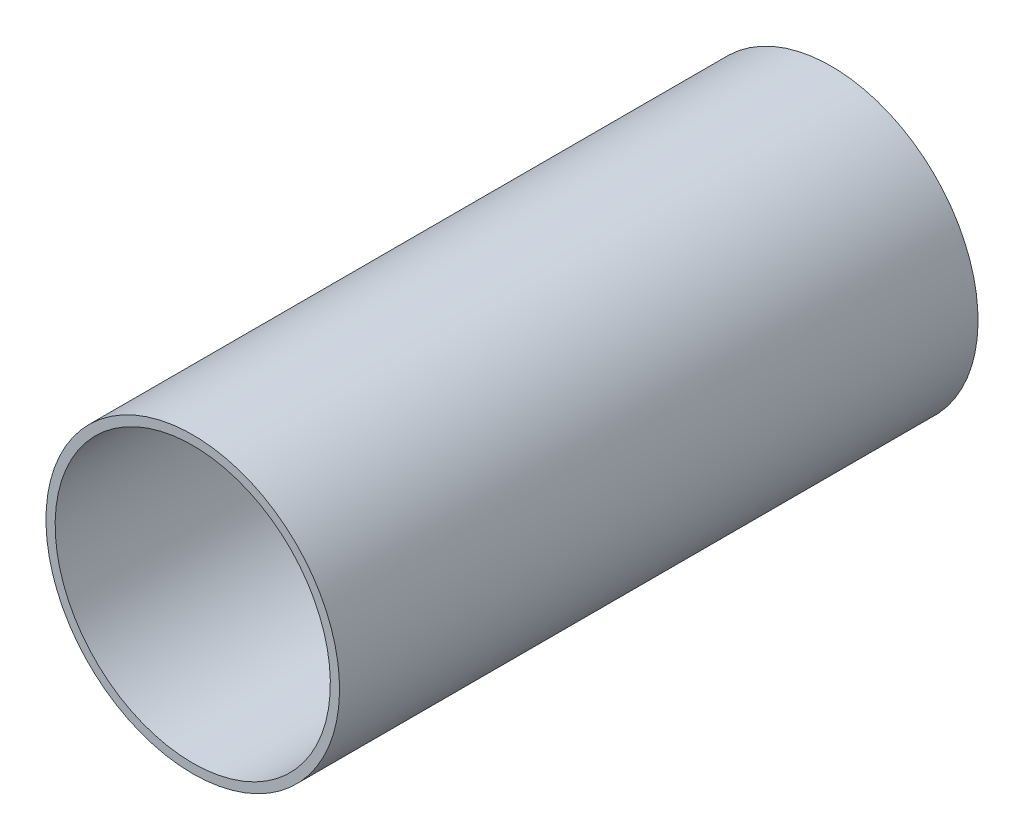
ISO-10303-21;
HEADER;
FILE_DESCRIPTION(('STEP AP214'),'2;1');
FILE_NAME('part.step','',(''),(''),'','','');
FILE_SCHEMA(('AUTOMOTIVE_DESIGN { 1 0 10303 214 1 1 1 1 }'));
ENDSEC;
DATA;
#1=APPLICATION_CONTEXT('core data for automotive mechanical design processes');
#2=APPLICATION_PROTOCOL_DEFINITION('international standard','automotive_design',2000,#1);
#3=PRODUCT_CONTEXT('',#1,'mechanical');
#4=PRODUCT('Part','Part','',(#3));
#5=PRODUCT_RELATED_PRODUCT_CATEGORY('part','',(#4));
#6=PRODUCT_DEFINITION_FORMATION('','',#4);
#7=PRODUCT_DEFINITION_CONTEXT('part definition',#1,'design');
#8=PRODUCT_DEFINITION('design','',#6,#7);
#9=PRODUCT_DEFINITION_SHAPE('','',#8);
#10=(LENGTH_UNIT() NAMED_UNIT(*) SI_UNIT(.MILLI.,.METRE.));
#11=(NAMED_UNIT(*) PLANE_ANGLE_UNIT() SI_UNIT($,.RADIAN.));
#12=(NAMED_UNIT(*) SI_UNIT($,.STERADIAN.) SOLID_ANGLE_UNIT());
#13=UNCERTAINTY_MEASURE_WITH_UNIT(LENGTH_MEASURE(1.E-05),#10,'distance_accuracy_value','');
#14=(GEOMETRIC_REPRESENTATION_CONTEXT(3) GLOBAL_UNCERTAINTY_ASSIGNED_CONTEXT((#13)) GLOBAL_UNIT_ASSIGNED_CONTEXT((#10,
#11,#12)) REPRESENTATION_CONTEXT('',''));
#15=CARTESIAN_POINT('',(0.,0.,0.));
#16=DIRECTION('',(0.,0.,1.));
#17=DIRECTION('',(1.,0.,0.));
#18=AXIS2_PLACEMENT_3D('',#15,#16,#17);
#19=CARTESIAN_POINT('',(127.,-103.632,-0.045));
#20=DIRECTION('',(0.,0.,-1.));
#21=DIRECTION('',(0.,-1.,0.));
#22=AXIS2_PLACEMENT_3D('',#19,#20,#21);
#23=CYLINDRICAL_SURFACE('',#22,0.375);
#24=CARTESIAN_POINT('',(127.,-103.632,-0.035));
#25=DIRECTION('',(0.,0.,-1.));
#26=DIRECTION('',(0.,-1.,0.));
#27=AXIS2_PLACEMENT_3D('',#24,#25,#26);
#28=CIRCLE('',#27,0.375);
#29=CARTESIAN_POINT('',(127.,-104.007,-0.035));
#30=VERTEX_POINT('',#29);
#31=EDGE_CURVE('E62',#30,#30,#28,.T.);
#32=ORIENTED_EDGE('',*,*,#31,.T.);
#33=DIRECTION('',(0.,0.,1.));
#34=VECTOR('',#33,1.);
#35=CARTESIAN_POINT('',(127.,-104.007,-0.045));
#36=LINE('',#35,#34);
#37=CARTESIAN_POINT('',(127.,-104.007,1.705));
#38=VERTEX_POINT('',#37);
#39=EDGE_CURVE('E11',#30,#38,#36,.T.);
#40=ORIENTED_EDGE('',*,*,#39,.T.);
#41=CARTESIAN_POINT('',(127.,-103.632,1.705));
#42=DIRECTION('',(0.,0.,-1.));
#43=DIRECTION('',(0.,-1.,0.));
#44=AXIS2_PLACEMENT_3D('',#41,#42,#43);
#45=CIRCLE('',#44,0.375);
#46=EDGE_CURVE('E26',#38,#38,#45,.T.);
#47=ORIENTED_EDGE('',*,*,#46,.F.);
#48=ORIENTED_EDGE('',*,*,#39,.F.);
#49=EDGE_LOOP('',(#32,#40,#47,#48));
#50=FACE_BOUND('',#49,.T.);
#51=ADVANCED_FACE('F17',(#50),#23,.F.);
#52=CARTESIAN_POINT('',(127.,-104.032,1.705));
#53=DIRECTION('',(0.,0.,1.));
#54=DIRECTION('',(1.,0.,0.));
#55=AXIS2_PLACEMENT_3D('',#52,#53,#54);
#56=PLANE('',#55);
#57=ORIENTED_EDGE('',*,*,#46,.T.);
#58=EDGE_LOOP('',(#57));
#59=FACE_BOUND('',#58,.T.);
#60=CARTESIAN_POINT('',(127.,-103.632,1.705));
#61=DIRECTION('',(0.,0.,1.));
#62=DIRECTION('',(0.,-1.,0.));
#63=AXIS2_PLACEMENT_3D('',#60,#61,#62);
#64=CIRCLE('',#63,0.4);
#65=CARTESIAN_POINT('',(127.,-104.032,1.705));
#66=VERTEX_POINT('',#65);
#67=EDGE_CURVE('E54',#66,#66,#64,.T.);
#68=ORIENTED_EDGE('',*,*,#67,.T.);
#69=EDGE_LOOP('',(#68));
#70=FACE_BOUND('',#69,.T.);
#71=ADVANCED_FACE('F71',(#59,#70),#56,.T.);
#72=CARTESIAN_POINT('',(127.,-104.032,-0.035));
#73=DIRECTION('',(0.,0.,1.));
#74=DIRECTION('',(1.,0.,0.));
#75=AXIS2_PLACEMENT_3D('',#72,#73,#74);
#76=PLANE('',#75);
#77=ORIENTED_EDGE('',*,*,#31,.F.);
#78=EDGE_LOOP('',(#77));
#79=FACE_BOUND('',#78,.T.);
#80=CARTESIAN_POINT('',(127.,-103.632,-0.035));
#81=DIRECTION('',(0.,0.,1.));
#82=DIRECTION('',(0.,-1.,0.));
#83=AXIS2_PLACEMENT_3D('',#80,#81,#82);
#84=CIRCLE('',#83,0.4);
#85=CARTESIAN_POINT('',(127.,-104.032,-0.035));
#86=VERTEX_POINT('',#85);
#87=EDGE_CURVE('E53',#86,#86,#84,.T.);
#88=ORIENTED_EDGE('',*,*,#87,.F.);
#89=EDGE_LOOP('',(#88));
#90=FACE_BOUND('',#89,.T.);
#91=ADVANCED_FACE('F75',(#79,#90),#76,.F.);
#92=CARTESIAN_POINT('',(127.,-103.632,-0.035));
#93=DIRECTION('',(0.,0.,-1.));
#94=DIRECTION('',(0.,-1.,0.));
#95=AXIS2_PLACEMENT_3D('',#92,#93,#94);
#96=CYLINDRICAL_SURFACE('',#95,0.4);
#97=ORIENTED_EDGE('',*,*,#87,.T.);
#98=DIRECTION('',(0.,0.,1.));
#99=VECTOR('',#98,1.);
#100=CARTESIAN_POINT('',(127.,-104.032,-0.035));
#101=LINE('',#100,#99);
#102=EDGE_CURVE('E50',#86,#66,#101,.T.);
#103=ORIENTED_EDGE('',*,*,#102,.T.);
#104=ORIENTED_EDGE('',*,*,#67,.F.);
#105=ORIENTED_EDGE('',*,*,#102,.F.);
#106=EDGE_LOOP('',(#97,#103,#104,#105));
#107=FACE_BOUND('',#106,.T.);
#108=ADVANCED_FACE('F51',(#107),#96,.T.);
#109=CLOSED_SHELL('',(#51,#71,#91,#108));
#110=MANIFOLD_SOLID_BREP('B1',#109);
#111=ADVANCED_BREP_SHAPE_REPRESENTATION('',(#18,#110),#14);
#112=SHAPE_DEFINITION_REPRESENTATION(#9,#111);
ENDSEC;
END-ISO-10303-21;
